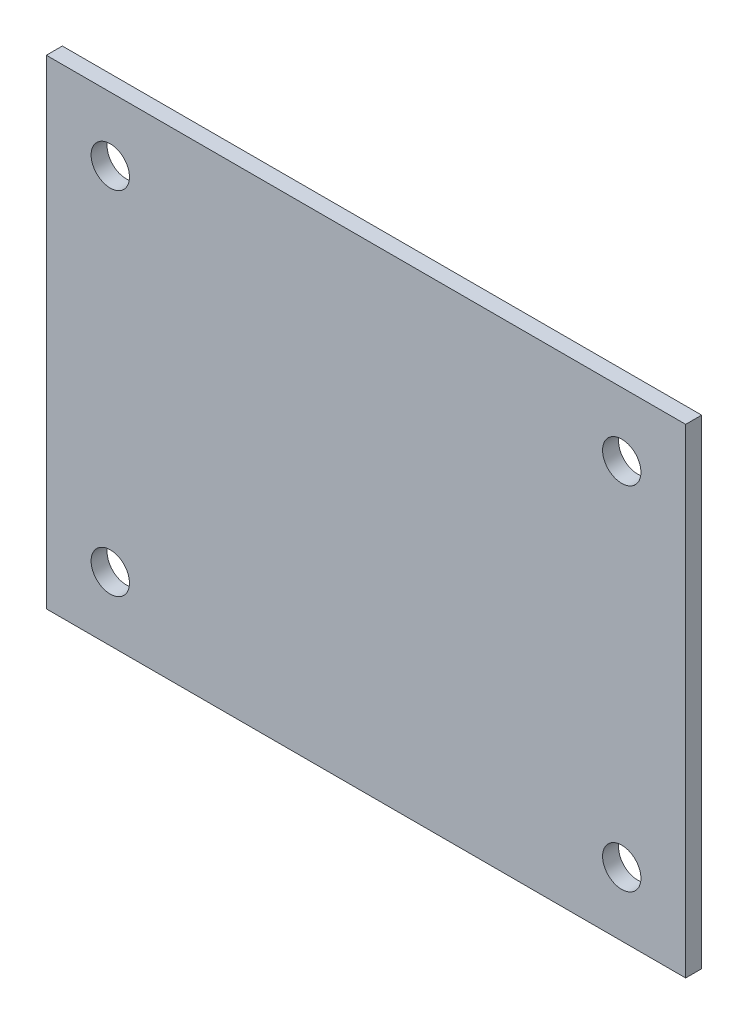
ISO-10303-21;
HEADER;
FILE_DESCRIPTION(('STEP AP214'),'2;1');
FILE_NAME('part.step','',(''),(''),'','','');
FILE_SCHEMA(('AUTOMOTIVE_DESIGN { 1 0 10303 214 1 1 1 1 }'));
ENDSEC;
DATA;
#1=APPLICATION_CONTEXT('core data for automotive mechanical design processes');
#2=APPLICATION_PROTOCOL_DEFINITION('international standard','automotive_design',2000,#1);
#3=PRODUCT_CONTEXT('',#1,'mechanical');
#4=PRODUCT('Part','Part','',(#3));
#5=PRODUCT_RELATED_PRODUCT_CATEGORY('part','',(#4));
#6=PRODUCT_DEFINITION_FORMATION('','',#4);
#7=PRODUCT_DEFINITION_CONTEXT('part definition',#1,'design');
#8=PRODUCT_DEFINITION('design','',#6,#7);
#9=PRODUCT_DEFINITION_SHAPE('','',#8);
#10=(LENGTH_UNIT() NAMED_UNIT(*) SI_UNIT(.MILLI.,.METRE.));
#11=(NAMED_UNIT(*) PLANE_ANGLE_UNIT() SI_UNIT($,.RADIAN.));
#12=(NAMED_UNIT(*) SI_UNIT($,.STERADIAN.) SOLID_ANGLE_UNIT());
#13=UNCERTAINTY_MEASURE_WITH_UNIT(LENGTH_MEASURE(1.E-05),#10,'distance_accuracy_value','');
#14=(GEOMETRIC_REPRESENTATION_CONTEXT(3) GLOBAL_UNCERTAINTY_ASSIGNED_CONTEXT((#13)) GLOBAL_UNIT_ASSIGNED_CONTEXT((#10,
#11,#12)) REPRESENTATION_CONTEXT('',''));
#15=CARTESIAN_POINT('',(0.,0.,0.));
#16=DIRECTION('',(0.,0.,1.));
#17=DIRECTION('',(1.,0.,0.));
#18=AXIS2_PLACEMENT_3D('',#15,#16,#17);
#19=CARTESIAN_POINT('',(0.,0.,0.));
#20=DIRECTION('',(0.,0.,1.));
#21=DIRECTION('',(1.,0.,0.));
#22=AXIS2_PLACEMENT_3D('',#19,#20,#21);
#23=PLANE('',#22);
#24=CARTESIAN_POINT('',(-30.0000000000003,79.9999999999983,0.));
#25=DIRECTION('',(0.,0.,1.));
#26=DIRECTION('',(1.,0.,0.));
#27=AXIS2_PLACEMENT_3D('',#24,#25,#26);
#28=CIRCLE('',#27,5.99999999999999);
#29=CARTESIAN_POINT('',(-24.0000000000003,79.9999999999983,0.));
#30=VERTEX_POINT('',#29);
#31=EDGE_CURVE('E161',#30,#30,#28,.T.);
#32=ORIENTED_EDGE('',*,*,#31,.F.);
#33=EDGE_LOOP('',(#32));
#34=FACE_BOUND('',#33,.T.);
#35=CARTESIAN_POINT('',(130.,79.9999999999983,0.));
#36=DIRECTION('',(0.,0.,1.));
#37=DIRECTION('',(1.,0.,0.));
#38=AXIS2_PLACEMENT_3D('',#35,#36,#37);
#39=CIRCLE('',#38,5.99999999999998);
#40=CARTESIAN_POINT('',(136.,79.9999999999983,0.));
#41=VERTEX_POINT('',#40);
#42=EDGE_CURVE('E153',#41,#41,#39,.T.);
#43=ORIENTED_EDGE('',*,*,#42,.F.);
#44=EDGE_LOOP('',(#43));
#45=FACE_BOUND('',#44,.T.);
#46=CARTESIAN_POINT('',(130.,-29.9999999999985,0.));
#47=DIRECTION('',(0.,0.,1.));
#48=DIRECTION('',(1.,0.,0.));
#49=AXIS2_PLACEMENT_3D('',#46,#47,#48);
#50=CIRCLE('',#49,5.99999999999998);
#51=CARTESIAN_POINT('',(136.,-29.9999999999985,0.));
#52=VERTEX_POINT('',#51);
#53=EDGE_CURVE('E145',#52,#52,#50,.T.);
#54=ORIENTED_EDGE('',*,*,#53,.F.);
#55=EDGE_LOOP('',(#54));
#56=FACE_BOUND('',#55,.T.);
#57=CARTESIAN_POINT('',(-30.0000000000003,-29.9999999999985,0.));
#58=DIRECTION('',(0.,0.,1.));
#59=DIRECTION('',(1.,0.,0.));
#60=AXIS2_PLACEMENT_3D('',#57,#58,#59);
#61=CIRCLE('',#60,5.99999999999999);
#62=CARTESIAN_POINT('',(-24.0000000000003,-29.9999999999985,0.));
#63=VERTEX_POINT('',#62);
#64=EDGE_CURVE('E137',#63,#63,#61,.T.);
#65=ORIENTED_EDGE('',*,*,#64,.F.);
#66=EDGE_LOOP('',(#65));
#67=FACE_BOUND('',#66,.T.);
#68=DIRECTION('',(0.,1.,0.));
#69=VECTOR('',#68,1.);
#70=CARTESIAN_POINT('',(-50.,-50.,0.));
#71=LINE('',#70,#69);
#72=CARTESIAN_POINT('',(-50.,-50.,0.));
#73=VERTEX_POINT('',#72);
#74=CARTESIAN_POINT('',(-50.,100.,0.));
#75=VERTEX_POINT('',#74);
#76=EDGE_CURVE('E114',#73,#75,#71,.T.);
#77=ORIENTED_EDGE('',*,*,#76,.F.);
#78=DIRECTION('',(-1.,0.,0.));
#79=VECTOR('',#78,1.);
#80=CARTESIAN_POINT('',(150.,-50.,0.));
#81=LINE('',#80,#79);
#82=CARTESIAN_POINT('',(150.,-50.,0.));
#83=VERTEX_POINT('',#82);
#84=EDGE_CURVE('E86',#83,#73,#81,.T.);
#85=ORIENTED_EDGE('',*,*,#84,.F.);
#86=DIRECTION('',(0.,-1.,0.));
#87=VECTOR('',#86,1.);
#88=CARTESIAN_POINT('',(150.,-50.,0.));
#89=LINE('',#88,#87);
#90=CARTESIAN_POINT('',(150.,100.,0.));
#91=VERTEX_POINT('',#90);
#92=EDGE_CURVE('E80',#91,#83,#89,.T.);
#93=ORIENTED_EDGE('',*,*,#92,.F.);
#94=DIRECTION('',(1.,0.,0.));
#95=VECTOR('',#94,1.);
#96=CARTESIAN_POINT('',(150.,100.,0.));
#97=LINE('',#96,#95);
#98=EDGE_CURVE('E103',#75,#91,#97,.T.);
#99=ORIENTED_EDGE('',*,*,#98,.F.);
#100=EDGE_LOOP('',(#77,#85,#93,#99));
#101=FACE_BOUND('',#100,.T.);
#102=ADVANCED_FACE('F45',(#34,#45,#56,#67,#101),#23,.T.);
#103=CARTESIAN_POINT('',(150.,100.,-5.));
#104=DIRECTION('',(0.,-1.,0.));
#105=DIRECTION('',(0.,0.,-1.));
#106=AXIS2_PLACEMENT_3D('',#103,#104,#105);
#107=PLANE('',#106);
#108=ORIENTED_EDGE('',*,*,#98,.T.);
#109=DIRECTION('',(0.,0.,1.));
#110=VECTOR('',#109,1.);
#111=CARTESIAN_POINT('',(150.,100.,-5.));
#112=LINE('',#111,#110);
#113=CARTESIAN_POINT('',(150.,100.,-5.));
#114=VERTEX_POINT('',#113);
#115=EDGE_CURVE('E55',#114,#91,#112,.T.);
#116=ORIENTED_EDGE('',*,*,#115,.F.);
#117=DIRECTION('',(1.,0.,0.));
#118=VECTOR('',#117,1.);
#119=CARTESIAN_POINT('',(150.,100.,-5.));
#120=LINE('',#119,#118);
#121=CARTESIAN_POINT('',(-50.,100.,-5.));
#122=VERTEX_POINT('',#121);
#123=EDGE_CURVE('E93',#122,#114,#120,.T.);
#124=ORIENTED_EDGE('',*,*,#123,.F.);
#125=DIRECTION('',(0.,0.,1.));
#126=VECTOR('',#125,1.);
#127=CARTESIAN_POINT('',(-50.,100.,-5.));
#128=LINE('',#127,#126);
#129=EDGE_CURVE('E11',#122,#75,#128,.T.);
#130=ORIENTED_EDGE('',*,*,#129,.T.);
#131=EDGE_LOOP('',(#108,#116,#124,#130));
#132=FACE_BOUND('',#131,.T.);
#133=ADVANCED_FACE('F102',(#132),#107,.F.);
#134=CARTESIAN_POINT('',(150.,-50.,-5.));
#135=DIRECTION('',(-1.,0.,0.));
#136=DIRECTION('',(0.,0.,1.));
#137=AXIS2_PLACEMENT_3D('',#134,#135,#136);
#138=PLANE('',#137);
#139=ORIENTED_EDGE('',*,*,#92,.T.);
#140=DIRECTION('',(0.,0.,1.));
#141=VECTOR('',#140,1.);
#142=CARTESIAN_POINT('',(150.,-50.,-5.));
#143=LINE('',#142,#141);
#144=CARTESIAN_POINT('',(150.,-50.,-5.));
#145=VERTEX_POINT('',#144);
#146=EDGE_CURVE('E105',#145,#83,#143,.T.);
#147=ORIENTED_EDGE('',*,*,#146,.F.);
#148=DIRECTION('',(0.,-1.,0.));
#149=VECTOR('',#148,1.);
#150=CARTESIAN_POINT('',(150.,-50.,-5.));
#151=LINE('',#150,#149);
#152=EDGE_CURVE('E96',#114,#145,#151,.T.);
#153=ORIENTED_EDGE('',*,*,#152,.F.);
#154=ORIENTED_EDGE('',*,*,#115,.T.);
#155=EDGE_LOOP('',(#139,#147,#153,#154));
#156=FACE_BOUND('',#155,.T.);
#157=ADVANCED_FACE('F106',(#156),#138,.F.);
#158=CARTESIAN_POINT('',(0.,0.,-5.));
#159=DIRECTION('',(0.,0.,1.));
#160=DIRECTION('',(1.,0.,0.));
#161=AXIS2_PLACEMENT_3D('',#158,#159,#160);
#162=PLANE('',#161);
#163=CARTESIAN_POINT('',(-30.0000000000003,79.9999999999983,-4.99999999999989));
#164=DIRECTION('',(0.,0.,1.));
#165=DIRECTION('',(1.,0.,0.));
#166=AXIS2_PLACEMENT_3D('',#163,#164,#165);
#167=CIRCLE('',#166,5.99999999999959);
#168=CARTESIAN_POINT('',(-24.0000000000007,79.9999999999983,-4.99999999999989));
#169=VERTEX_POINT('',#168);
#170=EDGE_CURVE('E157',#169,#169,#167,.T.);
#171=ORIENTED_EDGE('',*,*,#170,.T.);
#172=EDGE_LOOP('',(#171));
#173=FACE_BOUND('',#172,.T.);
#174=CARTESIAN_POINT('',(130.,79.9999999999983,-4.99999999999989));
#175=DIRECTION('',(0.,0.,1.));
#176=DIRECTION('',(1.,0.,0.));
#177=AXIS2_PLACEMENT_3D('',#174,#175,#176);
#178=CIRCLE('',#177,5.99999999999959);
#179=CARTESIAN_POINT('',(136.,79.9999999999983,-4.99999999999989));
#180=VERTEX_POINT('',#179);
#181=EDGE_CURVE('E149',#180,#180,#178,.T.);
#182=ORIENTED_EDGE('',*,*,#181,.T.);
#183=EDGE_LOOP('',(#182));
#184=FACE_BOUND('',#183,.T.);
#185=CARTESIAN_POINT('',(130.,-29.9999999999985,-4.99999999999989));
#186=DIRECTION('',(0.,0.,1.));
#187=DIRECTION('',(1.,0.,0.));
#188=AXIS2_PLACEMENT_3D('',#185,#186,#187);
#189=CIRCLE('',#188,5.99999999999959);
#190=CARTESIAN_POINT('',(136.,-29.9999999999985,-4.99999999999989));
#191=VERTEX_POINT('',#190);
#192=EDGE_CURVE('E141',#191,#191,#189,.T.);
#193=ORIENTED_EDGE('',*,*,#192,.T.);
#194=EDGE_LOOP('',(#193));
#195=FACE_BOUND('',#194,.T.);
#196=CARTESIAN_POINT('',(-30.0000000000003,-29.9999999999985,-4.99999999999989));
#197=DIRECTION('',(0.,0.,1.));
#198=DIRECTION('',(1.,0.,0.));
#199=AXIS2_PLACEMENT_3D('',#196,#197,#198);
#200=CIRCLE('',#199,5.99999999999959);
#201=CARTESIAN_POINT('',(-24.0000000000007,-29.9999999999985,-4.99999999999989));
#202=VERTEX_POINT('',#201);
#203=EDGE_CURVE('E118',#202,#202,#200,.T.);
#204=ORIENTED_EDGE('',*,*,#203,.T.);
#205=EDGE_LOOP('',(#204));
#206=FACE_BOUND('',#205,.T.);
#207=DIRECTION('',(0.,1.,0.));
#208=VECTOR('',#207,1.);
#209=CARTESIAN_POINT('',(-50.,-50.,-5.));
#210=LINE('',#209,#208);
#211=CARTESIAN_POINT('',(-50.,-50.,-5.));
#212=VERTEX_POINT('',#211);
#213=EDGE_CURVE('E98',#212,#122,#210,.T.);
#214=ORIENTED_EDGE('',*,*,#213,.T.);
#215=ORIENTED_EDGE('',*,*,#123,.T.);
#216=ORIENTED_EDGE('',*,*,#152,.T.);
#217=DIRECTION('',(-1.,0.,0.));
#218=VECTOR('',#217,1.);
#219=CARTESIAN_POINT('',(150.,-50.,-5.));
#220=LINE('',#219,#218);
#221=EDGE_CURVE('E63',#145,#212,#220,.T.);
#222=ORIENTED_EDGE('',*,*,#221,.T.);
#223=EDGE_LOOP('',(#214,#215,#216,#222));
#224=FACE_BOUND('',#223,.T.);
#225=ADVANCED_FACE('F94',(#173,#184,#195,#206,#224),#162,.F.);
#226=CARTESIAN_POINT('',(-50.,-50.,-5.));
#227=DIRECTION('',(1.,0.,0.));
#228=DIRECTION('',(0.,0.,-1.));
#229=AXIS2_PLACEMENT_3D('',#226,#227,#228);
#230=PLANE('',#229);
#231=ORIENTED_EDGE('',*,*,#76,.T.);
#232=ORIENTED_EDGE('',*,*,#129,.F.);
#233=ORIENTED_EDGE('',*,*,#213,.F.);
#234=DIRECTION('',(0.,0.,1.));
#235=VECTOR('',#234,1.);
#236=CARTESIAN_POINT('',(-50.,-50.,-5.));
#237=LINE('',#236,#235);
#238=EDGE_CURVE('E110',#212,#73,#237,.T.);
#239=ORIENTED_EDGE('',*,*,#238,.T.);
#240=EDGE_LOOP('',(#231,#232,#233,#239));
#241=FACE_BOUND('',#240,.T.);
#242=ADVANCED_FACE('F47',(#241),#230,.F.);
#243=CARTESIAN_POINT('',(150.,-50.,-5.));
#244=DIRECTION('',(0.,1.,0.));
#245=DIRECTION('',(0.,0.,1.));
#246=AXIS2_PLACEMENT_3D('',#243,#244,#245);
#247=PLANE('',#246);
#248=ORIENTED_EDGE('',*,*,#84,.T.);
#249=ORIENTED_EDGE('',*,*,#238,.F.);
#250=ORIENTED_EDGE('',*,*,#221,.F.);
#251=ORIENTED_EDGE('',*,*,#146,.T.);
#252=EDGE_LOOP('',(#248,#249,#250,#251));
#253=FACE_BOUND('',#252,.T.);
#254=ADVANCED_FACE('F128',(#253),#247,.F.);
#255=CARTESIAN_POINT('',(-30.0000000000003,-29.9999999999985,0.));
#256=DIRECTION('',(0.,0.,1.));
#257=DIRECTION('',(1.,0.,0.));
#258=AXIS2_PLACEMENT_3D('',#255,#256,#257);
#259=CYLINDRICAL_SURFACE('',#258,5.99999999999979);
#260=ORIENTED_EDGE('',*,*,#203,.F.);
#261=EDGE_LOOP('',(#260));
#262=FACE_BOUND('',#261,.T.);
#263=ORIENTED_EDGE('',*,*,#64,.T.);
#264=EDGE_LOOP('',(#263));
#265=FACE_BOUND('',#264,.T.);
#266=ADVANCED_FACE('F177',(#262,#265),#259,.F.);
#267=CARTESIAN_POINT('',(130.,-29.9999999999985,0.));
#268=DIRECTION('',(0.,0.,1.));
#269=DIRECTION('',(1.,0.,0.));
#270=AXIS2_PLACEMENT_3D('',#267,#268,#269);
#271=CYLINDRICAL_SURFACE('',#270,5.99999999999978);
#272=ORIENTED_EDGE('',*,*,#192,.F.);
#273=EDGE_LOOP('',(#272));
#274=FACE_BOUND('',#273,.T.);
#275=ORIENTED_EDGE('',*,*,#53,.T.);
#276=EDGE_LOOP('',(#275));
#277=FACE_BOUND('',#276,.T.);
#278=ADVANCED_FACE('F179',(#274,#277),#271,.F.);
#279=CARTESIAN_POINT('',(130.,79.9999999999983,0.));
#280=DIRECTION('',(0.,0.,1.));
#281=DIRECTION('',(1.,0.,0.));
#282=AXIS2_PLACEMENT_3D('',#279,#280,#281);
#283=CYLINDRICAL_SURFACE('',#282,5.99999999999978);
#284=ORIENTED_EDGE('',*,*,#181,.F.);
#285=EDGE_LOOP('',(#284));
#286=FACE_BOUND('',#285,.T.);
#287=ORIENTED_EDGE('',*,*,#42,.T.);
#288=EDGE_LOOP('',(#287));
#289=FACE_BOUND('',#288,.T.);
#290=ADVANCED_FACE('F186',(#286,#289),#283,.F.);
#291=CARTESIAN_POINT('',(-30.0000000000003,79.9999999999983,0.));
#292=DIRECTION('',(0.,0.,1.));
#293=DIRECTION('',(1.,0.,0.));
#294=AXIS2_PLACEMENT_3D('',#291,#292,#293);
#295=CYLINDRICAL_SURFACE('',#294,5.99999999999979);
#296=ORIENTED_EDGE('',*,*,#170,.F.);
#297=EDGE_LOOP('',(#296));
#298=FACE_BOUND('',#297,.T.);
#299=ORIENTED_EDGE('',*,*,#31,.T.);
#300=EDGE_LOOP('',(#299));
#301=FACE_BOUND('',#300,.T.);
#302=ADVANCED_FACE('F166',(#298,#301),#295,.F.);
#303=CLOSED_SHELL('',(#102,#133,#157,#225,#242,#254,#266,#278,#290,#302));
#304=MANIFOLD_SOLID_BREP('B2',#303);
#305=ADVANCED_BREP_SHAPE_REPRESENTATION('',(#18,#304),#14);
#306=SHAPE_DEFINITION_REPRESENTATION(#9,#305);
ENDSEC;
END-ISO-10303-21;
